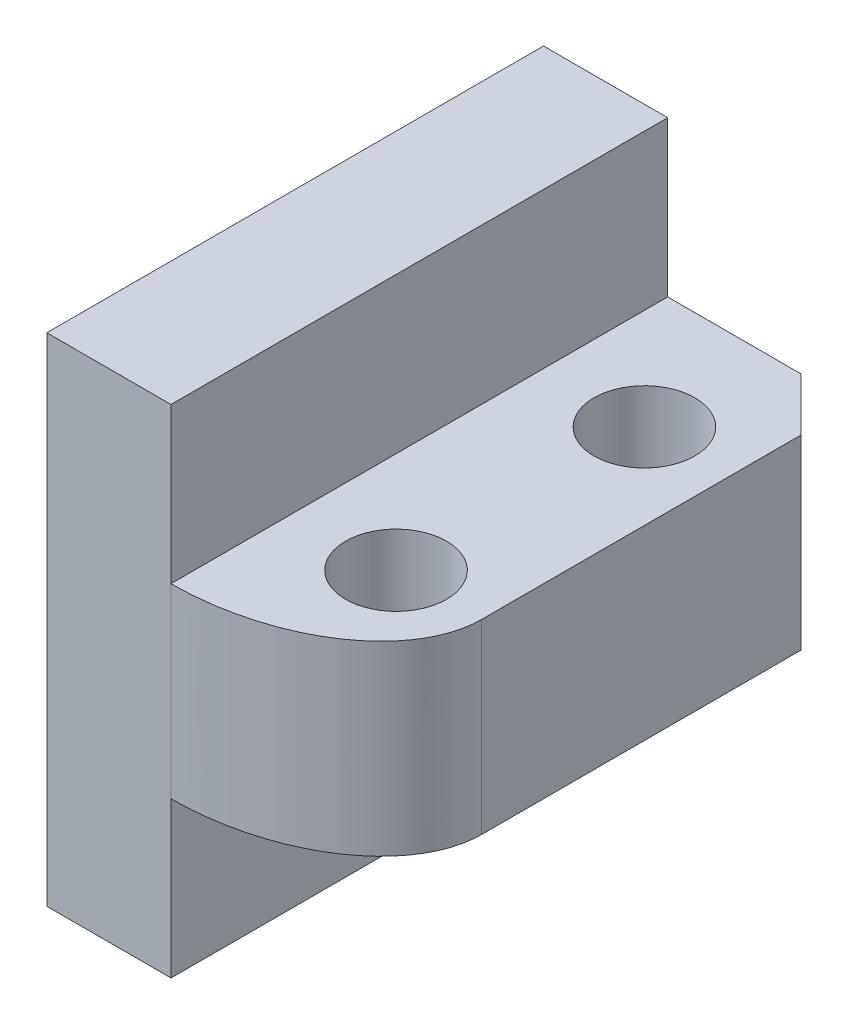
ISO-10303-21;
HEADER;
FILE_DESCRIPTION(('STEP AP214'),'2;1');
FILE_NAME('part.step','',(''),(''),'','','');
FILE_SCHEMA(('AUTOMOTIVE_DESIGN { 1 0 10303 214 1 1 1 1 }'));
ENDSEC;
DATA;
#1=APPLICATION_CONTEXT('core data for automotive mechanical design processes');
#2=APPLICATION_PROTOCOL_DEFINITION('international standard','automotive_design',2000,#1);
#3=PRODUCT_CONTEXT('',#1,'mechanical');
#4=PRODUCT('Part','Part','',(#3));
#5=PRODUCT_RELATED_PRODUCT_CATEGORY('part','',(#4));
#6=PRODUCT_DEFINITION_FORMATION('','',#4);
#7=PRODUCT_DEFINITION_CONTEXT('part definition',#1,'design');
#8=PRODUCT_DEFINITION('design','',#6,#7);
#9=PRODUCT_DEFINITION_SHAPE('','',#8);
#10=(LENGTH_UNIT() NAMED_UNIT(*) SI_UNIT(.MILLI.,.METRE.));
#11=(NAMED_UNIT(*) PLANE_ANGLE_UNIT() SI_UNIT($,.RADIAN.));
#12=(NAMED_UNIT(*) SI_UNIT($,.STERADIAN.) SOLID_ANGLE_UNIT());
#13=UNCERTAINTY_MEASURE_WITH_UNIT(LENGTH_MEASURE(1.E-05),#10,'distance_accuracy_value','');
#14=(GEOMETRIC_REPRESENTATION_CONTEXT(3) GLOBAL_UNCERTAINTY_ASSIGNED_CONTEXT((#13)) GLOBAL_UNIT_ASSIGNED_CONTEXT((#10,
#11,#12)) REPRESENTATION_CONTEXT('',''));
#15=CARTESIAN_POINT('',(0.,0.,0.));
#16=DIRECTION('',(0.,0.,1.));
#17=DIRECTION('',(1.,0.,0.));
#18=AXIS2_PLACEMENT_3D('',#15,#16,#17);
#19=CARTESIAN_POINT('',(0.,-8.,16.));
#20=DIRECTION('',(0.,1.,0.));
#21=DIRECTION('',(0.,0.,1.));
#22=AXIS2_PLACEMENT_3D('',#19,#20,#21);
#23=PLANE('',#22);
#24=DIRECTION('',(1.,0.,0.));
#25=VECTOR('',#24,1.);
#26=CARTESIAN_POINT('',(0.,-8.,0.));
#27=LINE('',#26,#25);
#28=CARTESIAN_POINT('',(-4.,-8.,0.));
#29=VERTEX_POINT('',#28);
#30=CARTESIAN_POINT('',(0.,-8.,0.));
#31=VERTEX_POINT('',#30);
#32=EDGE_CURVE('E151',#29,#31,#27,.T.);
#33=ORIENTED_EDGE('',*,*,#32,.T.);
#34=DIRECTION('',(0.,0.,-1.));
#35=VECTOR('',#34,1.);
#36=CARTESIAN_POINT('',(0.,-8.,16.));
#37=LINE('',#36,#35);
#38=CARTESIAN_POINT('',(0.,-8.,16.));
#39=VERTEX_POINT('',#38);
#40=EDGE_CURVE('E131',#39,#31,#37,.T.);
#41=ORIENTED_EDGE('',*,*,#40,.F.);
#42=DIRECTION('',(1.,0.,0.));
#43=VECTOR('',#42,1.);
#44=CARTESIAN_POINT('',(0.,-8.,16.));
#45=LINE('',#44,#43);
#46=CARTESIAN_POINT('',(-4.,-8.,16.));
#47=VERTEX_POINT('',#46);
#48=EDGE_CURVE('E139',#47,#39,#45,.T.);
#49=ORIENTED_EDGE('',*,*,#48,.F.);
#50=DIRECTION('',(0.,0.,-1.));
#51=VECTOR('',#50,1.);
#52=CARTESIAN_POINT('',(-4.,-8.,16.));
#53=LINE('',#52,#51);
#54=EDGE_CURVE('E289',#47,#29,#53,.T.);
#55=ORIENTED_EDGE('',*,*,#54,.T.);
#56=EDGE_LOOP('',(#33,#41,#49,#55));
#57=FACE_BOUND('',#56,.T.);
#58=ADVANCED_FACE('F49',(#57),#23,.F.);
#59=CARTESIAN_POINT('',(0.,-3.,16.));
#60=DIRECTION('',(-1.,0.,0.));
#61=DIRECTION('',(0.,-1.,0.));
#62=AXIS2_PLACEMENT_3D('',#59,#60,#61);
#63=PLANE('',#62);
#64=DIRECTION('',(0.,1.,0.));
#65=VECTOR('',#64,1.);
#66=CARTESIAN_POINT('',(0.,-3.,0.));
#67=LINE('',#66,#65);
#68=CARTESIAN_POINT('',(0.,-3.,0.));
#69=VERTEX_POINT('',#68);
#70=EDGE_CURVE('E278',#31,#69,#67,.T.);
#71=ORIENTED_EDGE('',*,*,#70,.T.);
#72=DIRECTION('',(0.,0.,-1.));
#73=VECTOR('',#72,1.);
#74=CARTESIAN_POINT('',(0.,-3.,16.));
#75=LINE('',#74,#73);
#76=CARTESIAN_POINT('',(0.,-3.,16.));
#77=VERTEX_POINT('',#76);
#78=EDGE_CURVE('E134',#77,#69,#75,.T.);
#79=ORIENTED_EDGE('',*,*,#78,.F.);
#80=DIRECTION('',(0.,1.,0.));
#81=VECTOR('',#80,1.);
#82=CARTESIAN_POINT('',(0.,-3.,16.));
#83=LINE('',#82,#81);
#84=EDGE_CURVE('E127',#39,#77,#83,.T.);
#85=ORIENTED_EDGE('',*,*,#84,.F.);
#86=ORIENTED_EDGE('',*,*,#40,.T.);
#87=EDGE_LOOP('',(#71,#79,#85,#86));
#88=FACE_BOUND('',#87,.T.);
#89=ADVANCED_FACE('F129',(#88),#63,.F.);
#90=CARTESIAN_POINT('',(6.,-3.,16.));
#91=DIRECTION('',(0.,1.,0.));
#92=DIRECTION('',(0.,0.,1.));
#93=AXIS2_PLACEMENT_3D('',#90,#91,#92);
#94=PLANE('',#93);
#95=CARTESIAN_POINT('',(3.25,-3.,12.));
#96=DIRECTION('',(0.,-1.,0.));
#97=DIRECTION('',(0.,0.,-1.));
#98=AXIS2_PLACEMENT_3D('',#95,#96,#97);
#99=CIRCLE('',#98,1.625);
#100=CARTESIAN_POINT('',(3.25,-3.,10.375));
#101=VERTEX_POINT('',#100);
#102=EDGE_CURVE('E167',#101,#101,#99,.T.);
#103=ORIENTED_EDGE('',*,*,#102,.F.);
#104=EDGE_LOOP('',(#103));
#105=FACE_BOUND('',#104,.T.);
#106=CARTESIAN_POINT('',(3.25,-3.,4.));
#107=DIRECTION('',(0.,-1.,0.));
#108=DIRECTION('',(0.,0.,-1.));
#109=AXIS2_PLACEMENT_3D('',#106,#107,#108);
#110=CIRCLE('',#109,1.625);
#111=CARTESIAN_POINT('',(3.25,-3.,2.375));
#112=VERTEX_POINT('',#111);
#113=EDGE_CURVE('E320',#112,#112,#110,.T.);
#114=ORIENTED_EDGE('',*,*,#113,.F.);
#115=EDGE_LOOP('',(#114));
#116=FACE_BOUND('',#115,.T.);
#117=DIRECTION('',(0.,0.,-1.));
#118=VECTOR('',#117,1.);
#119=CARTESIAN_POINT('',(6.,-3.,16.));
#120=LINE('',#119,#118);
#121=CARTESIAN_POINT('',(6.,-3.,12.));
#122=VERTEX_POINT('',#121);
#123=CARTESIAN_POINT('',(6.,-3.,1.7));
#124=VERTEX_POINT('',#123);
#125=EDGE_CURVE('E157',#122,#124,#120,.T.);
#126=ORIENTED_EDGE('',*,*,#125,.F.);
#127=CARTESIAN_POINT('',(0.,-3.,16.));
#128=CARTESIAN_POINT('',(6.,-3.,16.));
#129=CARTESIAN_POINT('',(6.,-3.,12.));
#130=(BOUNDED_CURVE() B_SPLINE_CURVE(2,(#127,#128,#129),.UNSPECIFIED.,.F.,
.F.) B_SPLINE_CURVE_WITH_KNOTS((3,3),(0.,1.),
.UNSPECIFIED.) CURVE() GEOMETRIC_REPRESENTATION_ITEM() RATIONAL_B_SPLINE_CURVE((1.,
0.707106781186547,1.)) REPRESENTATION_ITEM(''));
#131=EDGE_CURVE('E12',#122,#77,#130,.F.);
#132=ORIENTED_EDGE('',*,*,#131,.T.);
#133=ORIENTED_EDGE('',*,*,#78,.T.);
#134=DIRECTION('',(1.,0.,0.));
#135=VECTOR('',#134,1.);
#136=CARTESIAN_POINT('',(6.,-3.,0.));
#137=LINE('',#136,#135);
#138=CARTESIAN_POINT('',(4.29999999999999,-3.,0.));
#139=VERTEX_POINT('',#138);
#140=EDGE_CURVE('E276',#69,#139,#137,.T.);
#141=ORIENTED_EDGE('',*,*,#140,.T.);
#142=DIRECTION('',(0.707106781186549,0.,0.707106781186546));
#143=VECTOR('',#142,1.);
#144=CARTESIAN_POINT('',(6.,-3.,1.7));
#145=LINE('',#144,#143);
#146=EDGE_CURVE('E173',#139,#124,#145,.T.);
#147=ORIENTED_EDGE('',*,*,#146,.T.);
#148=EDGE_LOOP('',(#126,#132,#133,#141,#147));
#149=FACE_BOUND('',#148,.T.);
#150=ADVANCED_FACE('F244',(#105,#116,#149),#94,.F.);
#151=CARTESIAN_POINT('',(6.,3.,16.));
#152=DIRECTION('',(-1.,0.,0.));
#153=DIRECTION('',(0.,0.,1.));
#154=AXIS2_PLACEMENT_3D('',#151,#152,#153);
#155=PLANE('',#154);
#156=DIRECTION('',(0.,0.,-1.));
#157=VECTOR('',#156,1.);
#158=CARTESIAN_POINT('',(6.,3.,16.));
#159=LINE('',#158,#157);
#160=CARTESIAN_POINT('',(6.,3.,12.));
#161=VERTEX_POINT('',#160);
#162=CARTESIAN_POINT('',(6.,3.,1.7));
#163=VERTEX_POINT('',#162);
#164=EDGE_CURVE('E227',#161,#163,#159,.T.);
#165=ORIENTED_EDGE('',*,*,#164,.F.);
#166=CARTESIAN_POINT('',(6.,-3.3,12.));
#167=CARTESIAN_POINT('',(6.,-1.1,12.));
#168=CARTESIAN_POINT('',(6.,1.1,12.));
#169=CARTESIAN_POINT('',(6.,3.3,12.));
#170=(BOUNDED_CURVE() B_SPLINE_CURVE(3,(#166,#167,#168,#169),.UNSPECIFIED.,.F.,
.F.) B_SPLINE_CURVE_WITH_KNOTS((4,4),(-0.0033,0.0033),
.UNSPECIFIED.) CURVE() GEOMETRIC_REPRESENTATION_ITEM() RATIONAL_B_SPLINE_CURVE((1.,1.,1.,1.)) REPRESENTATION_ITEM(''));
#171=EDGE_CURVE('E63',#161,#122,#170,.F.);
#172=ORIENTED_EDGE('',*,*,#171,.T.);
#173=ORIENTED_EDGE('',*,*,#125,.T.);
#174=DIRECTION('',(0.,1.,0.));
#175=VECTOR('',#174,1.);
#176=CARTESIAN_POINT('',(6.,3.,1.7));
#177=LINE('',#176,#175);
#178=EDGE_CURVE('E152',#124,#163,#177,.T.);
#179=ORIENTED_EDGE('',*,*,#178,.T.);
#180=EDGE_LOOP('',(#165,#172,#173,#179));
#181=FACE_BOUND('',#180,.T.);
#182=ADVANCED_FACE('F213',(#181),#155,.F.);
#183=CARTESIAN_POINT('',(0.,3.,16.));
#184=DIRECTION('',(0.,-1.,0.));
#185=DIRECTION('',(0.,0.,-1.));
#186=AXIS2_PLACEMENT_3D('',#183,#184,#185);
#187=PLANE('',#186);
#188=CARTESIAN_POINT('',(3.25,3.,12.));
#189=DIRECTION('',(0.,-1.,0.));
#190=DIRECTION('',(0.,0.,-1.));
#191=AXIS2_PLACEMENT_3D('',#188,#189,#190);
#192=CIRCLE('',#191,1.625);
#193=CARTESIAN_POINT('',(3.25,3.,10.375));
#194=VERTEX_POINT('',#193);
#195=EDGE_CURVE('E166',#194,#194,#192,.T.);
#196=ORIENTED_EDGE('',*,*,#195,.T.);
#197=EDGE_LOOP('',(#196));
#198=FACE_BOUND('',#197,.T.);
#199=CARTESIAN_POINT('',(3.25,3.,4.));
#200=DIRECTION('',(0.,-1.,0.));
#201=DIRECTION('',(0.,0.,-1.));
#202=AXIS2_PLACEMENT_3D('',#199,#200,#201);
#203=CIRCLE('',#202,1.625);
#204=CARTESIAN_POINT('',(3.25,3.,2.375));
#205=VERTEX_POINT('',#204);
#206=EDGE_CURVE('E163',#205,#205,#203,.T.);
#207=ORIENTED_EDGE('',*,*,#206,.T.);
#208=EDGE_LOOP('',(#207));
#209=FACE_BOUND('',#208,.T.);
#210=DIRECTION('',(0.,0.,-1.));
#211=VECTOR('',#210,1.);
#212=CARTESIAN_POINT('',(0.,3.,16.));
#213=LINE('',#212,#211);
#214=CARTESIAN_POINT('',(0.,3.,16.));
#215=VERTEX_POINT('',#214);
#216=CARTESIAN_POINT('',(0.,3.,0.));
#217=VERTEX_POINT('',#216);
#218=EDGE_CURVE('E296',#215,#217,#213,.T.);
#219=ORIENTED_EDGE('',*,*,#218,.F.);
#220=CARTESIAN_POINT('',(6.,3.,12.));
#221=CARTESIAN_POINT('',(6.,3.,16.));
#222=CARTESIAN_POINT('',(0.,3.,16.));
#223=(BOUNDED_CURVE() B_SPLINE_CURVE(2,(#220,#221,#222),.UNSPECIFIED.,.F.,
.F.) B_SPLINE_CURVE_WITH_KNOTS((3,3),(0.,1.),
.UNSPECIFIED.) CURVE() GEOMETRIC_REPRESENTATION_ITEM() RATIONAL_B_SPLINE_CURVE((1.,
0.707106781186547,1.)) REPRESENTATION_ITEM(''));
#224=EDGE_CURVE('E78',#215,#161,#223,.F.);
#225=ORIENTED_EDGE('',*,*,#224,.T.);
#226=ORIENTED_EDGE('',*,*,#164,.T.);
#227=DIRECTION('',(-0.707106781186549,0.,-0.707106781186546));
#228=VECTOR('',#227,1.);
#229=CARTESIAN_POINT('',(6.,3.,1.7));
#230=LINE('',#229,#228);
#231=CARTESIAN_POINT('',(4.29999999999999,3.,0.));
#232=VERTEX_POINT('',#231);
#233=EDGE_CURVE('E155',#163,#232,#230,.T.);
#234=ORIENTED_EDGE('',*,*,#233,.T.);
#235=DIRECTION('',(-1.,0.,0.));
#236=VECTOR('',#235,1.);
#237=CARTESIAN_POINT('',(0.,3.,0.));
#238=LINE('',#237,#236);
#239=EDGE_CURVE('E277',#232,#217,#238,.T.);
#240=ORIENTED_EDGE('',*,*,#239,.T.);
#241=EDGE_LOOP('',(#219,#225,#226,#234,#240));
#242=FACE_BOUND('',#241,.T.);
#243=ADVANCED_FACE('F208',(#198,#209,#242),#187,.F.);
#244=CARTESIAN_POINT('',(0.,8.,16.));
#245=DIRECTION('',(-1.,0.,0.));
#246=DIRECTION('',(0.,-1.,0.));
#247=AXIS2_PLACEMENT_3D('',#244,#245,#246);
#248=PLANE('',#247);
#249=DIRECTION('',(0.,1.,0.));
#250=VECTOR('',#249,1.);
#251=CARTESIAN_POINT('',(0.,8.,0.));
#252=LINE('',#251,#250);
#253=CARTESIAN_POINT('',(0.,8.,0.));
#254=VERTEX_POINT('',#253);
#255=EDGE_CURVE('E280',#217,#254,#252,.T.);
#256=ORIENTED_EDGE('',*,*,#255,.T.);
#257=DIRECTION('',(0.,0.,-1.));
#258=VECTOR('',#257,1.);
#259=CARTESIAN_POINT('',(0.,8.,16.));
#260=LINE('',#259,#258);
#261=CARTESIAN_POINT('',(0.,8.,16.));
#262=VERTEX_POINT('',#261);
#263=EDGE_CURVE('E294',#262,#254,#260,.T.);
#264=ORIENTED_EDGE('',*,*,#263,.F.);
#265=DIRECTION('',(0.,1.,0.));
#266=VECTOR('',#265,1.);
#267=CARTESIAN_POINT('',(0.,8.,16.));
#268=LINE('',#267,#266);
#269=EDGE_CURVE('E138',#215,#262,#268,.T.);
#270=ORIENTED_EDGE('',*,*,#269,.F.);
#271=ORIENTED_EDGE('',*,*,#218,.T.);
#272=EDGE_LOOP('',(#256,#264,#270,#271));
#273=FACE_BOUND('',#272,.T.);
#274=ADVANCED_FACE('F204',(#273),#248,.F.);
#275=CARTESIAN_POINT('',(-4.,8.,16.));
#276=DIRECTION('',(0.,-1.,0.));
#277=DIRECTION('',(0.,0.,-1.));
#278=AXIS2_PLACEMENT_3D('',#275,#276,#277);
#279=PLANE('',#278);
#280=DIRECTION('',(-1.,0.,0.));
#281=VECTOR('',#280,1.);
#282=CARTESIAN_POINT('',(-4.,8.,0.));
#283=LINE('',#282,#281);
#284=CARTESIAN_POINT('',(-4.,8.,0.));
#285=VERTEX_POINT('',#284);
#286=EDGE_CURVE('E286',#254,#285,#283,.T.);
#287=ORIENTED_EDGE('',*,*,#286,.T.);
#288=DIRECTION('',(0.,0.,-1.));
#289=VECTOR('',#288,1.);
#290=CARTESIAN_POINT('',(-4.,8.,16.));
#291=LINE('',#290,#289);
#292=CARTESIAN_POINT('',(-4.,8.,16.));
#293=VERTEX_POINT('',#292);
#294=EDGE_CURVE('E291',#293,#285,#291,.T.);
#295=ORIENTED_EDGE('',*,*,#294,.F.);
#296=DIRECTION('',(-1.,0.,0.));
#297=VECTOR('',#296,1.);
#298=CARTESIAN_POINT('',(-4.,8.,16.));
#299=LINE('',#298,#297);
#300=EDGE_CURVE('E302',#262,#293,#299,.T.);
#301=ORIENTED_EDGE('',*,*,#300,.F.);
#302=ORIENTED_EDGE('',*,*,#263,.T.);
#303=EDGE_LOOP('',(#287,#295,#301,#302));
#304=FACE_BOUND('',#303,.T.);
#305=ADVANCED_FACE('F200',(#304),#279,.F.);
#306=CARTESIAN_POINT('',(-4.,-8.,16.));
#307=DIRECTION('',(1.,0.,0.));
#308=DIRECTION('',(0.,0.,-1.));
#309=AXIS2_PLACEMENT_3D('',#306,#307,#308);
#310=PLANE('',#309);
#311=DIRECTION('',(0.,-1.,0.));
#312=VECTOR('',#311,1.);
#313=CARTESIAN_POINT('',(-4.,-8.,0.));
#314=LINE('',#313,#312);
#315=EDGE_CURVE('E148',#285,#29,#314,.T.);
#316=ORIENTED_EDGE('',*,*,#315,.T.);
#317=ORIENTED_EDGE('',*,*,#54,.F.);
#318=DIRECTION('',(0.,-1.,0.));
#319=VECTOR('',#318,1.);
#320=CARTESIAN_POINT('',(-4.,-8.,16.));
#321=LINE('',#320,#319);
#322=EDGE_CURVE('E144',#293,#47,#321,.T.);
#323=ORIENTED_EDGE('',*,*,#322,.F.);
#324=ORIENTED_EDGE('',*,*,#294,.T.);
#325=EDGE_LOOP('',(#316,#317,#323,#324));
#326=FACE_BOUND('',#325,.T.);
#327=ADVANCED_FACE('F192',(#326),#310,.F.);
#328=CARTESIAN_POINT('',(0.,0.,16.));
#329=DIRECTION('',(0.,0.,-1.));
#330=DIRECTION('',(-1.,0.,0.));
#331=AXIS2_PLACEMENT_3D('',#328,#329,#330);
#332=PLANE('',#331);
#333=ORIENTED_EDGE('',*,*,#84,.T.);
#334=CARTESIAN_POINT('',(0.,3.3,16.));
#335=CARTESIAN_POINT('',(0.,1.1,16.));
#336=CARTESIAN_POINT('',(0.,-1.1,16.));
#337=CARTESIAN_POINT('',(0.,-3.3,16.));
#338=(BOUNDED_CURVE() B_SPLINE_CURVE(3,(#334,#335,#336,#337),.UNSPECIFIED.,.F.,
.F.) B_SPLINE_CURVE_WITH_KNOTS((4,4),(-0.0033,0.0033),
.UNSPECIFIED.) CURVE() GEOMETRIC_REPRESENTATION_ITEM() RATIONAL_B_SPLINE_CURVE((1.,1.,1.,1.)) REPRESENTATION_ITEM(''));
#339=EDGE_CURVE('E176',#77,#215,#338,.F.);
#340=ORIENTED_EDGE('',*,*,#339,.T.);
#341=ORIENTED_EDGE('',*,*,#269,.T.);
#342=ORIENTED_EDGE('',*,*,#300,.T.);
#343=ORIENTED_EDGE('',*,*,#322,.T.);
#344=ORIENTED_EDGE('',*,*,#48,.T.);
#345=EDGE_LOOP('',(#333,#340,#341,#342,#343,#344));
#346=FACE_BOUND('',#345,.T.);
#347=ADVANCED_FACE('F142',(#346),#332,.F.);
#348=CARTESIAN_POINT('',(0.,0.,0.));
#349=DIRECTION('',(0.,0.,-1.));
#350=DIRECTION('',(-1.,0.,0.));
#351=AXIS2_PLACEMENT_3D('',#348,#349,#350);
#352=PLANE('',#351);
#353=ORIENTED_EDGE('',*,*,#239,.F.);
#354=DIRECTION('',(0.,-1.,0.));
#355=VECTOR('',#354,1.);
#356=CARTESIAN_POINT('',(4.29999999999999,-3.,0.));
#357=LINE('',#356,#355);
#358=EDGE_CURVE('E171',#232,#139,#357,.T.);
#359=ORIENTED_EDGE('',*,*,#358,.T.);
#360=ORIENTED_EDGE('',*,*,#140,.F.);
#361=ORIENTED_EDGE('',*,*,#70,.F.);
#362=ORIENTED_EDGE('',*,*,#32,.F.);
#363=ORIENTED_EDGE('',*,*,#315,.F.);
#364=ORIENTED_EDGE('',*,*,#286,.F.);
#365=ORIENTED_EDGE('',*,*,#255,.F.);
#366=EDGE_LOOP('',(#353,#359,#360,#361,#362,#363,#364,#365));
#367=FACE_BOUND('',#366,.T.);
#368=ADVANCED_FACE('F191',(#367),#352,.T.);
#369=CARTESIAN_POINT('',(3.25,8.,4.));
#370=DIRECTION('',(0.,-1.,0.));
#371=DIRECTION('',(0.,0.,-1.));
#372=AXIS2_PLACEMENT_3D('',#369,#370,#371);
#373=CYLINDRICAL_SURFACE('',#372,1.625);
#374=ORIENTED_EDGE('',*,*,#113,.T.);
#375=EDGE_LOOP('',(#374));
#376=FACE_BOUND('',#375,.T.);
#377=ORIENTED_EDGE('',*,*,#206,.F.);
#378=EDGE_LOOP('',(#377));
#379=FACE_BOUND('',#378,.T.);
#380=ADVANCED_FACE('F193',(#376,#379),#373,.F.);
#381=CARTESIAN_POINT('',(3.25,8.,12.));
#382=DIRECTION('',(0.,-1.,0.));
#383=DIRECTION('',(0.,0.,-1.));
#384=AXIS2_PLACEMENT_3D('',#381,#382,#383);
#385=CYLINDRICAL_SURFACE('',#384,1.625);
#386=ORIENTED_EDGE('',*,*,#102,.T.);
#387=EDGE_LOOP('',(#386));
#388=FACE_BOUND('',#387,.T.);
#389=ORIENTED_EDGE('',*,*,#195,.F.);
#390=EDGE_LOOP('',(#389));
#391=FACE_BOUND('',#390,.T.);
#392=ADVANCED_FACE('F262',(#388,#391),#385,.F.);
#393=CARTESIAN_POINT('',(6.,3.,1.7));
#394=DIRECTION('',(0.707106781186546,0.,-0.707106781186549));
#395=DIRECTION('',(0.,-1.,0.));
#396=AXIS2_PLACEMENT_3D('',#393,#394,#395);
#397=PLANE('',#396);
#398=ORIENTED_EDGE('',*,*,#146,.F.);
#399=ORIENTED_EDGE('',*,*,#358,.F.);
#400=ORIENTED_EDGE('',*,*,#233,.F.);
#401=ORIENTED_EDGE('',*,*,#178,.F.);
#402=EDGE_LOOP('',(#398,#399,#400,#401));
#403=FACE_BOUND('',#402,.T.);
#404=ADVANCED_FACE('F258',(#403),#397,.T.);
#405=CARTESIAN_POINT('',(0.,-3.3,16.));
#406=CARTESIAN_POINT('',(0.,-1.1,16.));
#407=CARTESIAN_POINT('',(0.,1.1,16.));
#408=CARTESIAN_POINT('',(0.,3.3,16.));
#409=CARTESIAN_POINT('',(6.,-3.3,16.));
#410=CARTESIAN_POINT('',(6.,-1.1,16.));
#411=CARTESIAN_POINT('',(6.,1.1,16.));
#412=CARTESIAN_POINT('',(6.,3.3,16.));
#413=CARTESIAN_POINT('',(6.,-3.3,12.));
#414=CARTESIAN_POINT('',(6.,-1.1,12.));
#415=CARTESIAN_POINT('',(6.,1.1,12.));
#416=CARTESIAN_POINT('',(6.,3.3,12.));
#417=(BOUNDED_SURFACE() B_SPLINE_SURFACE(2,3,((#405,#406,#407,#408),(#409,#410,#411,#412),(#413,
#414,#415,#416)),.UNSPECIFIED.,.F.,.F.,.F.) B_SPLINE_SURFACE_WITH_KNOTS((3,3),(4,4),(0.,1.),
(-0.0033,0.0033),.UNSPECIFIED.) GEOMETRIC_REPRESENTATION_ITEM() RATIONAL_B_SPLINE_SURFACE(((1.,
1.,1.,1.),(0.707106781186547,0.707106781186547,0.707106781186547,0.707106781186547),(1.,1.,1.,1.))) REPRESENTATION_ITEM('') SURFACE());
#418=ORIENTED_EDGE('',*,*,#131,.F.);
#419=ORIENTED_EDGE('',*,*,#171,.F.);
#420=ORIENTED_EDGE('',*,*,#224,.F.);
#421=ORIENTED_EDGE('',*,*,#339,.F.);
#422=EDGE_LOOP('',(#418,#419,#420,#421));
#423=FACE_BOUND('',#422,.T.);
#424=ADVANCED_FACE('F52',(#423),#417,.T.);
#425=CLOSED_SHELL('',(#58,#89,#150,#182,#243,#274,#305,#327,#347,#368,#380,#392,#404,#424));
#426=MANIFOLD_SOLID_BREP('B2',#425);
#427=ADVANCED_BREP_SHAPE_REPRESENTATION('',(#18,#426),#14);
#428=SHAPE_DEFINITION_REPRESENTATION(#9,#427);
ENDSEC;
END-ISO-10303-21;
